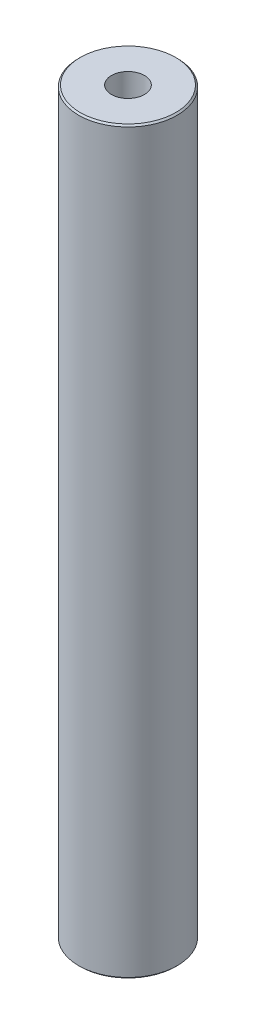
ISO-10303-21;
HEADER;
FILE_DESCRIPTION(('STEP AP214'),'2;1');
FILE_NAME('part.step','',(''),(''),'','','');
FILE_SCHEMA(('AUTOMOTIVE_DESIGN { 1 0 10303 214 1 1 1 1 }'));
ENDSEC;
DATA;
#1=APPLICATION_CONTEXT('core data for automotive mechanical design processes');
#2=APPLICATION_PROTOCOL_DEFINITION('international standard','automotive_design',2000,#1);
#3=PRODUCT_CONTEXT('',#1,'mechanical');
#4=PRODUCT('Part','Part','',(#3));
#5=PRODUCT_RELATED_PRODUCT_CATEGORY('part','',(#4));
#6=PRODUCT_DEFINITION_FORMATION('','',#4);
#7=PRODUCT_DEFINITION_CONTEXT('part definition',#1,'design');
#8=PRODUCT_DEFINITION('design','',#6,#7);
#9=PRODUCT_DEFINITION_SHAPE('','',#8);
#10=(LENGTH_UNIT() NAMED_UNIT(*) SI_UNIT(.MILLI.,.METRE.));
#11=(NAMED_UNIT(*) PLANE_ANGLE_UNIT() SI_UNIT($,.RADIAN.));
#12=(NAMED_UNIT(*) SI_UNIT($,.STERADIAN.) SOLID_ANGLE_UNIT());
#13=UNCERTAINTY_MEASURE_WITH_UNIT(LENGTH_MEASURE(1.E-05),#10,'distance_accuracy_value','');
#14=(GEOMETRIC_REPRESENTATION_CONTEXT(3) GLOBAL_UNCERTAINTY_ASSIGNED_CONTEXT((#13)) GLOBAL_UNIT_ASSIGNED_CONTEXT((#10,
#11,#12)) REPRESENTATION_CONTEXT('',''));
#15=CARTESIAN_POINT('',(0.,0.,0.));
#16=DIRECTION('',(0.,0.,1.));
#17=DIRECTION('',(1.,0.,0.));
#18=AXIS2_PLACEMENT_3D('',#15,#16,#17);
#19=CARTESIAN_POINT('',(0.,600.,0.));
#20=DIRECTION('',(0.,-1.,0.));
#21=DIRECTION('',(0.,0.,-1.));
#22=AXIS2_PLACEMENT_3D('',#19,#20,#21);
#23=CYLINDRICAL_SURFACE('',#22,40.);
#24=CARTESIAN_POINT('',(0.,598.741494366292,0.));
#25=DIRECTION('',(0.,1.,0.));
#26=DIRECTION('',(0.,0.,1.));
#27=AXIS2_PLACEMENT_3D('',#24,#25,#26);
#28=CIRCLE('',#27,40.);
#29=CARTESIAN_POINT('',(0.,598.741494366292,40.));
#30=VERTEX_POINT('',#29);
#31=EDGE_CURVE('E50',#30,#30,#28,.F.);
#32=ORIENTED_EDGE('',*,*,#31,.T.);
#33=EDGE_LOOP('',(#32));
#34=FACE_BOUND('',#33,.T.);
#35=CARTESIAN_POINT('',(0.,1.25850563370733,0.));
#36=DIRECTION('',(0.,1.,0.));
#37=DIRECTION('',(0.,0.,1.));
#38=AXIS2_PLACEMENT_3D('',#35,#36,#37);
#39=CIRCLE('',#38,40.);
#40=CARTESIAN_POINT('',(0.,1.25850563370733,40.));
#41=VERTEX_POINT('',#40);
#42=EDGE_CURVE('E51',#41,#41,#39,.T.);
#43=ORIENTED_EDGE('',*,*,#42,.T.);
#44=EDGE_LOOP('',(#43));
#45=FACE_BOUND('',#44,.T.);
#46=ADVANCED_FACE('F39',(#34,#45),#23,.T.);
#47=CARTESIAN_POINT('',(0.,600.,0.));
#48=DIRECTION('',(0.,1.,0.));
#49=DIRECTION('',(0.,0.,1.));
#50=AXIS2_PLACEMENT_3D('',#47,#48,#49);
#51=PLANE('',#50);
#52=CARTESIAN_POINT('',(0.,600.,0.));
#53=DIRECTION('',(0.,1.,0.));
#54=DIRECTION('',(0.,0.,1.));
#55=AXIS2_PLACEMENT_3D('',#52,#53,#54);
#56=CIRCLE('',#55,38.7414943662926);
#57=CARTESIAN_POINT('',(0.,600.,38.7414943662926));
#58=VERTEX_POINT('',#57);
#59=EDGE_CURVE('E54',#58,#58,#56,.T.);
#60=ORIENTED_EDGE('',*,*,#59,.T.);
#61=EDGE_LOOP('',(#60));
#62=FACE_BOUND('',#61,.T.);
#63=CARTESIAN_POINT('',(0.,600.,0.));
#64=DIRECTION('',(0.,1.,0.));
#65=DIRECTION('',(0.,0.,1.));
#66=AXIS2_PLACEMENT_3D('',#63,#64,#65);
#67=CIRCLE('',#66,13.4100925434438);
#68=CARTESIAN_POINT('',(0.,600.,13.4100925434438));
#69=VERTEX_POINT('',#68);
#70=EDGE_CURVE('E58',#69,#69,#67,.T.);
#71=ORIENTED_EDGE('',*,*,#70,.F.);
#72=EDGE_LOOP('',(#71));
#73=FACE_BOUND('',#72,.T.);
#74=ADVANCED_FACE('F69',(#62,#73),#51,.T.);
#75=CARTESIAN_POINT('',(0.,0.,0.));
#76=DIRECTION('',(0.,1.,0.));
#77=DIRECTION('',(0.,0.,1.));
#78=AXIS2_PLACEMENT_3D('',#75,#76,#77);
#79=PLANE('',#78);
#80=CARTESIAN_POINT('',(0.,0.,0.));
#81=DIRECTION('',(0.,1.,0.));
#82=DIRECTION('',(0.,0.,1.));
#83=AXIS2_PLACEMENT_3D('',#80,#81,#82);
#84=CIRCLE('',#83,38.7414943662926);
#85=CARTESIAN_POINT('',(0.,0.,38.7414943662926));
#86=VERTEX_POINT('',#85);
#87=EDGE_CURVE('E10',#86,#86,#84,.F.);
#88=ORIENTED_EDGE('',*,*,#87,.T.);
#89=EDGE_LOOP('',(#88));
#90=FACE_BOUND('',#89,.T.);
#91=CARTESIAN_POINT('',(0.,0.,0.));
#92=DIRECTION('',(0.,1.,0.));
#93=DIRECTION('',(0.,0.,1.));
#94=AXIS2_PLACEMENT_3D('',#91,#92,#93);
#95=CIRCLE('',#94,13.4100925434438);
#96=CARTESIAN_POINT('',(0.,0.,13.4100925434438));
#97=VERTEX_POINT('',#96);
#98=EDGE_CURVE('E63',#97,#97,#95,.T.);
#99=ORIENTED_EDGE('',*,*,#98,.T.);
#100=EDGE_LOOP('',(#99));
#101=FACE_BOUND('',#100,.T.);
#102=ADVANCED_FACE('F75',(#90,#101),#79,.F.);
#103=CARTESIAN_POINT('',(0.,600.,0.));
#104=DIRECTION('',(0.,-1.,0.));
#105=DIRECTION('',(0.,0.,-1.));
#106=AXIS2_PLACEMENT_3D('',#103,#104,#105);
#107=CYLINDRICAL_SURFACE('',#106,13.4100925434438);
#108=ORIENTED_EDGE('',*,*,#70,.T.);
#109=EDGE_LOOP('',(#108));
#110=FACE_BOUND('',#109,.T.);
#111=ORIENTED_EDGE('',*,*,#98,.F.);
#112=EDGE_LOOP('',(#111));
#113=FACE_BOUND('',#112,.T.);
#114=ADVANCED_FACE('F70',(#110,#113),#107,.F.);
#115=CARTESIAN_POINT('',(0.,600.,0.));
#116=DIRECTION('',(0.,-1.,0.));
#117=DIRECTION('',(0.,0.,-1.));
#118=AXIS2_PLACEMENT_3D('',#115,#116,#117);
#119=CONICAL_SURFACE('',#118,38.7414943662926,0.785398163397435);
#120=ORIENTED_EDGE('',*,*,#31,.F.);
#121=EDGE_LOOP('',(#120));
#122=FACE_BOUND('',#121,.T.);
#123=ORIENTED_EDGE('',*,*,#59,.F.);
#124=EDGE_LOOP('',(#123));
#125=FACE_BOUND('',#124,.T.);
#126=ADVANCED_FACE('F81',(#122,#125),#119,.T.);
#127=CARTESIAN_POINT('',(0.,1.25850563370733,0.));
#128=DIRECTION('',(0.,1.,0.));
#129=DIRECTION('',(0.,0.,1.));
#130=AXIS2_PLACEMENT_3D('',#127,#128,#129);
#131=CONICAL_SURFACE('',#130,40.,0.785398163397457);
#132=ORIENTED_EDGE('',*,*,#87,.F.);
#133=EDGE_LOOP('',(#132));
#134=FACE_BOUND('',#133,.T.);
#135=ORIENTED_EDGE('',*,*,#42,.F.);
#136=EDGE_LOOP('',(#135));
#137=FACE_BOUND('',#136,.T.);
#138=ADVANCED_FACE('F45',(#134,#137),#131,.T.);
#139=CLOSED_SHELL('',(#46,#74,#102,#114,#126,#138));
#140=MANIFOLD_SOLID_BREP('B2',#139);
#141=ADVANCED_BREP_SHAPE_REPRESENTATION('',(#18,#140),#14);
#142=SHAPE_DEFINITION_REPRESENTATION(#9,#141);
ENDSEC;
END-ISO-10303-21;
